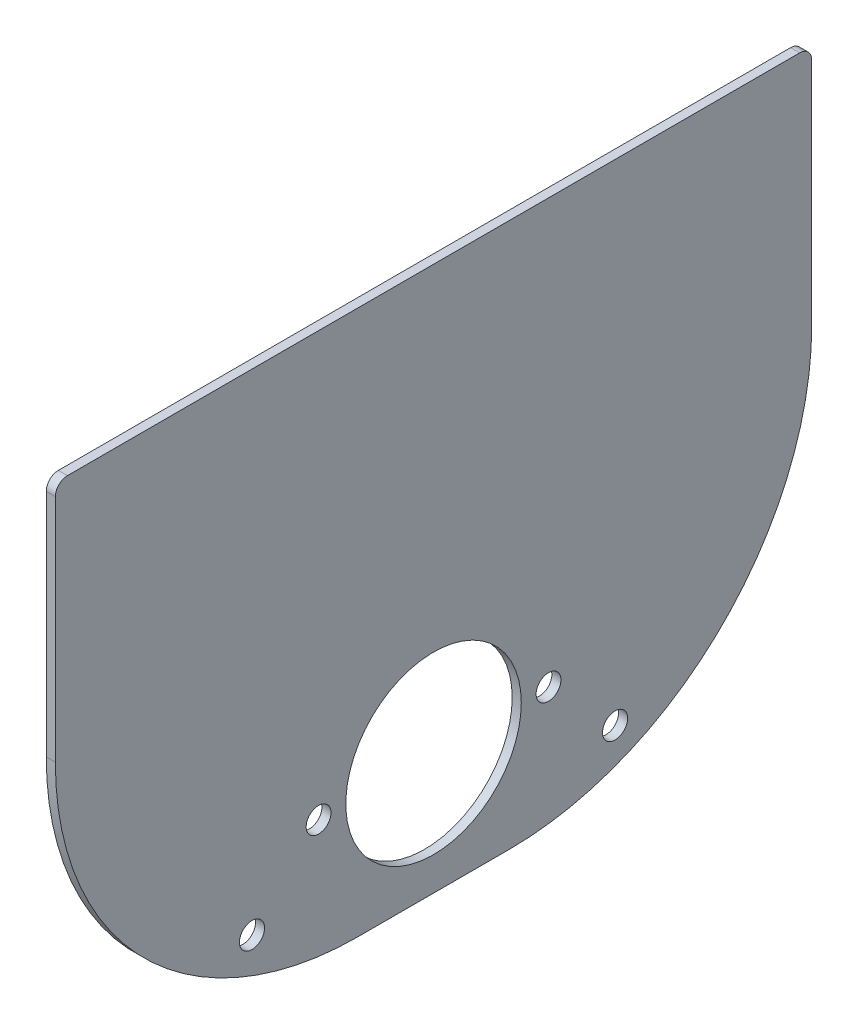
ISO-10303-21;
HEADER;
FILE_DESCRIPTION(('STEP AP214'),'2;1');
FILE_NAME('part.step','',(''),(''),'','','');
FILE_SCHEMA(('AUTOMOTIVE_DESIGN { 1 0 10303 214 1 1 1 1 }'));
ENDSEC;
DATA;
#1=APPLICATION_CONTEXT('core data for automotive mechanical design processes');
#2=APPLICATION_PROTOCOL_DEFINITION('international standard','automotive_design',2000,#1);
#3=PRODUCT_CONTEXT('',#1,'mechanical');
#4=PRODUCT('Part','Part','',(#3));
#5=PRODUCT_RELATED_PRODUCT_CATEGORY('part','',(#4));
#6=PRODUCT_DEFINITION_FORMATION('','',#4);
#7=PRODUCT_DEFINITION_CONTEXT('part definition',#1,'design');
#8=PRODUCT_DEFINITION('design','',#6,#7);
#9=PRODUCT_DEFINITION_SHAPE('','',#8);
#10=(LENGTH_UNIT() NAMED_UNIT(*) SI_UNIT(.MILLI.,.METRE.));
#11=(NAMED_UNIT(*) PLANE_ANGLE_UNIT() SI_UNIT($,.RADIAN.));
#12=(NAMED_UNIT(*) SI_UNIT($,.STERADIAN.) SOLID_ANGLE_UNIT());
#13=UNCERTAINTY_MEASURE_WITH_UNIT(LENGTH_MEASURE(1.E-05),#10,'distance_accuracy_value','');
#14=(GEOMETRIC_REPRESENTATION_CONTEXT(3) GLOBAL_UNCERTAINTY_ASSIGNED_CONTEXT((#13)) GLOBAL_UNIT_ASSIGNED_CONTEXT((#10,
#11,#12)) REPRESENTATION_CONTEXT('',''));
#15=CARTESIAN_POINT('',(0.,0.,0.));
#16=DIRECTION('',(0.,0.,1.));
#17=DIRECTION('',(1.,0.,0.));
#18=AXIS2_PLACEMENT_3D('',#15,#16,#17);
#19=CARTESIAN_POINT('',(3.,60.0000000000001,-25.));
#20=DIRECTION('',(1.,0.,0.));
#21=DIRECTION('',(0.,0.,-1.));
#22=AXIS2_PLACEMENT_3D('',#19,#20,#21);
#23=PLANE('',#22);
#24=CARTESIAN_POINT('',(3.,-22.,60.0000000000001));
#25=DIRECTION('',(1.,0.,0.));
#26=DIRECTION('',(0.,0.,-1.));
#27=AXIS2_PLACEMENT_3D('',#24,#25,#26);
#28=CIRCLE('',#27,4.15);
#29=CARTESIAN_POINT('',(3.,-22.,55.8500000000001));
#30=VERTEX_POINT('',#29);
#31=EDGE_CURVE('E205',#30,#30,#28,.T.);
#32=ORIENTED_EDGE('',*,*,#31,.F.);
#33=EDGE_LOOP('',(#32));
#34=FACE_BOUND('',#33,.T.);
#35=CARTESIAN_POINT('',(3.,0.,-38.));
#36=DIRECTION('',(1.,0.,0.));
#37=DIRECTION('',(0.,0.,-1.));
#38=AXIS2_PLACEMENT_3D('',#35,#36,#37);
#39=CIRCLE('',#38,4.1);
#40=CARTESIAN_POINT('',(3.,0.,-42.1));
#41=VERTEX_POINT('',#40);
#42=EDGE_CURVE('E193',#41,#41,#39,.T.);
#43=ORIENTED_EDGE('',*,*,#42,.F.);
#44=EDGE_LOOP('',(#43));
#45=FACE_BOUND('',#44,.T.);
#46=CARTESIAN_POINT('',(3.,60.0000000000001,-25.));
#47=DIRECTION('',(1.,0.,0.));
#48=DIRECTION('',(0.,0.,-1.));
#49=AXIS2_PLACEMENT_3D('',#46,#47,#48);
#50=CIRCLE('',#49,100.);
#51=CARTESIAN_POINT('',(3.,-40.,-25.));
#52=VERTEX_POINT('',#51);
#53=CARTESIAN_POINT('',(3.,60.0000000000001,-125.));
#54=VERTEX_POINT('',#53);
#55=EDGE_CURVE('E156',#52,#54,#50,.T.);
#56=ORIENTED_EDGE('',*,*,#55,.T.);
#57=DIRECTION('',(0.,1.,0.));
#58=VECTOR('',#57,1.);
#59=CARTESIAN_POINT('',(3.,136.,-125.));
#60=LINE('',#59,#58);
#61=CARTESIAN_POINT('',(3.,136.,-125.));
#62=VERTEX_POINT('',#61);
#63=EDGE_CURVE('E104',#54,#62,#60,.T.);
#64=ORIENTED_EDGE('',*,*,#63,.T.);
#65=CARTESIAN_POINT('',(3.,136.,-121.));
#66=DIRECTION('',(1.,0.,0.));
#67=DIRECTION('',(0.,0.,1.));
#68=AXIS2_PLACEMENT_3D('',#65,#66,#67);
#69=CIRCLE('',#68,3.99999999999999);
#70=CARTESIAN_POINT('',(3.,140.,-121.));
#71=VERTEX_POINT('',#70);
#72=EDGE_CURVE('E171',#62,#71,#69,.T.);
#73=ORIENTED_EDGE('',*,*,#72,.T.);
#74=DIRECTION('',(0.,0.,1.));
#75=VECTOR('',#74,1.);
#76=CARTESIAN_POINT('',(3.,140.,121.));
#77=LINE('',#76,#75);
#78=CARTESIAN_POINT('',(3.,140.,121.));
#79=VERTEX_POINT('',#78);
#80=EDGE_CURVE('E184',#71,#79,#77,.T.);
#81=ORIENTED_EDGE('',*,*,#80,.T.);
#82=CARTESIAN_POINT('',(3.,136.,121.));
#83=DIRECTION('',(1.,0.,0.));
#84=DIRECTION('',(0.,0.,-1.));
#85=AXIS2_PLACEMENT_3D('',#82,#83,#84);
#86=CIRCLE('',#85,4.);
#87=CARTESIAN_POINT('',(3.,136.,125.));
#88=VERTEX_POINT('',#87);
#89=EDGE_CURVE('E123',#79,#88,#86,.T.);
#90=ORIENTED_EDGE('',*,*,#89,.T.);
#91=DIRECTION('',(0.,-1.,0.));
#92=VECTOR('',#91,1.);
#93=CARTESIAN_POINT('',(3.,136.,125.));
#94=LINE('',#93,#92);
#95=CARTESIAN_POINT('',(3.,60.0000000000001,125.));
#96=VERTEX_POINT('',#95);
#97=EDGE_CURVE('E117',#88,#96,#94,.T.);
#98=ORIENTED_EDGE('',*,*,#97,.T.);
#99=CARTESIAN_POINT('',(3.,60.0000000000001,25.));
#100=DIRECTION('',(1.,0.,0.));
#101=DIRECTION('',(0.,0.,-1.));
#102=AXIS2_PLACEMENT_3D('',#99,#100,#101);
#103=CIRCLE('',#102,100.);
#104=CARTESIAN_POINT('',(3.,-40.,25.));
#105=VERTEX_POINT('',#104);
#106=EDGE_CURVE('E121',#96,#105,#103,.T.);
#107=ORIENTED_EDGE('',*,*,#106,.T.);
#108=DIRECTION('',(0.,0.,-1.));
#109=VECTOR('',#108,1.);
#110=CARTESIAN_POINT('',(3.,-40.,25.));
#111=LINE('',#110,#109);
#112=EDGE_CURVE('E61',#105,#52,#111,.T.);
#113=ORIENTED_EDGE('',*,*,#112,.T.);
#114=EDGE_LOOP('',(#56,#64,#73,#81,#90,#98,#107,#113));
#115=FACE_BOUND('',#114,.T.);
#116=CARTESIAN_POINT('',(3.,0.,0.));
#117=DIRECTION('',(1.,0.,0.));
#118=DIRECTION('',(0.,0.,-1.));
#119=AXIS2_PLACEMENT_3D('',#116,#117,#118);
#120=CIRCLE('',#119,29.);
#121=CARTESIAN_POINT('',(3.,0.,-29.));
#122=VERTEX_POINT('',#121);
#123=EDGE_CURVE('E145',#122,#122,#120,.T.);
#124=ORIENTED_EDGE('',*,*,#123,.F.);
#125=EDGE_LOOP('',(#124));
#126=FACE_BOUND('',#125,.T.);
#127=CARTESIAN_POINT('',(3.,0.,38.));
#128=DIRECTION('',(1.,0.,0.));
#129=DIRECTION('',(0.,0.,-1.));
#130=AXIS2_PLACEMENT_3D('',#127,#128,#129);
#131=CIRCLE('',#130,4.1);
#132=CARTESIAN_POINT('',(3.,0.,33.9));
#133=VERTEX_POINT('',#132);
#134=EDGE_CURVE('E199',#133,#133,#131,.T.);
#135=ORIENTED_EDGE('',*,*,#134,.F.);
#136=EDGE_LOOP('',(#135));
#137=FACE_BOUND('',#136,.T.);
#138=CARTESIAN_POINT('',(3.,-22.,-60.0000000000001));
#139=DIRECTION('',(1.,0.,0.));
#140=DIRECTION('',(0.,0.,-1.));
#141=AXIS2_PLACEMENT_3D('',#138,#139,#140);
#142=CIRCLE('',#141,4.14999999999999);
#143=CARTESIAN_POINT('',(3.,-22.,-64.1500000000001));
#144=VERTEX_POINT('',#143);
#145=EDGE_CURVE('E211',#144,#144,#142,.T.);
#146=ORIENTED_EDGE('',*,*,#145,.F.);
#147=EDGE_LOOP('',(#146));
#148=FACE_BOUND('',#147,.T.);
#149=ADVANCED_FACE('F44',(#34,#45,#115,#126,#137,#148),#23,.T.);
#150=CARTESIAN_POINT('',(0.,60.0000000000001,-25.));
#151=DIRECTION('',(1.,0.,0.));
#152=DIRECTION('',(0.,0.,-1.));
#153=AXIS2_PLACEMENT_3D('',#150,#151,#152);
#154=PLANE('',#153);
#155=CARTESIAN_POINT('',(0.,60.0000000000001,-25.));
#156=DIRECTION('',(1.,0.,0.));
#157=DIRECTION('',(0.,0.,-1.));
#158=AXIS2_PLACEMENT_3D('',#155,#156,#157);
#159=CIRCLE('',#158,100.);
#160=CARTESIAN_POINT('',(0.,-40.,-25.));
#161=VERTEX_POINT('',#160);
#162=CARTESIAN_POINT('',(0.,60.0000000000001,-125.));
#163=VERTEX_POINT('',#162);
#164=EDGE_CURVE('E141',#161,#163,#159,.T.);
#165=ORIENTED_EDGE('',*,*,#164,.F.);
#166=DIRECTION('',(0.,0.,-1.));
#167=VECTOR('',#166,1.);
#168=CARTESIAN_POINT('',(0.,-40.,25.));
#169=LINE('',#168,#167);
#170=CARTESIAN_POINT('',(0.,-40.,25.));
#171=VERTEX_POINT('',#170);
#172=EDGE_CURVE('E96',#171,#161,#169,.T.);
#173=ORIENTED_EDGE('',*,*,#172,.F.);
#174=CARTESIAN_POINT('',(0.,60.0000000000001,25.));
#175=DIRECTION('',(1.,0.,0.));
#176=DIRECTION('',(0.,0.,-1.));
#177=AXIS2_PLACEMENT_3D('',#174,#175,#176);
#178=CIRCLE('',#177,100.);
#179=CARTESIAN_POINT('',(0.,60.0000000000001,125.));
#180=VERTEX_POINT('',#179);
#181=EDGE_CURVE('E90',#180,#171,#178,.T.);
#182=ORIENTED_EDGE('',*,*,#181,.F.);
#183=DIRECTION('',(0.,-1.,0.));
#184=VECTOR('',#183,1.);
#185=CARTESIAN_POINT('',(0.,136.,125.));
#186=LINE('',#185,#184);
#187=CARTESIAN_POINT('',(0.,136.,125.));
#188=VERTEX_POINT('',#187);
#189=EDGE_CURVE('E131',#188,#180,#186,.T.);
#190=ORIENTED_EDGE('',*,*,#189,.F.);
#191=CARTESIAN_POINT('',(0.,136.,121.));
#192=DIRECTION('',(1.,0.,0.));
#193=DIRECTION('',(0.,0.,-1.));
#194=AXIS2_PLACEMENT_3D('',#191,#192,#193);
#195=CIRCLE('',#194,4.);
#196=CARTESIAN_POINT('',(0.,140.,121.));
#197=VERTEX_POINT('',#196);
#198=EDGE_CURVE('E151',#197,#188,#195,.T.);
#199=ORIENTED_EDGE('',*,*,#198,.F.);
#200=DIRECTION('',(0.,0.,1.));
#201=VECTOR('',#200,1.);
#202=CARTESIAN_POINT('',(0.,140.,121.));
#203=LINE('',#202,#201);
#204=CARTESIAN_POINT('',(0.,140.,-121.));
#205=VERTEX_POINT('',#204);
#206=EDGE_CURVE('E149',#205,#197,#203,.T.);
#207=ORIENTED_EDGE('',*,*,#206,.F.);
#208=CARTESIAN_POINT('',(0.,136.,-121.));
#209=DIRECTION('',(1.,0.,0.));
#210=DIRECTION('',(0.,0.,1.));
#211=AXIS2_PLACEMENT_3D('',#208,#209,#210);
#212=CIRCLE('',#211,3.99999999999999);
#213=CARTESIAN_POINT('',(0.,136.,-125.));
#214=VERTEX_POINT('',#213);
#215=EDGE_CURVE('E147',#214,#205,#212,.T.);
#216=ORIENTED_EDGE('',*,*,#215,.F.);
#217=DIRECTION('',(0.,1.,0.));
#218=VECTOR('',#217,1.);
#219=CARTESIAN_POINT('',(0.,136.,-125.));
#220=LINE('',#219,#218);
#221=EDGE_CURVE('E144',#163,#214,#220,.T.);
#222=ORIENTED_EDGE('',*,*,#221,.F.);
#223=EDGE_LOOP('',(#165,#173,#182,#190,#199,#207,#216,#222));
#224=FACE_BOUND('',#223,.T.);
#225=CARTESIAN_POINT('',(0.,0.,0.));
#226=DIRECTION('',(1.,0.,0.));
#227=DIRECTION('',(0.,0.,-1.));
#228=AXIS2_PLACEMENT_3D('',#225,#226,#227);
#229=CIRCLE('',#228,29.);
#230=CARTESIAN_POINT('',(0.,0.,-29.));
#231=VERTEX_POINT('',#230);
#232=EDGE_CURVE('E190',#231,#231,#229,.T.);
#233=ORIENTED_EDGE('',*,*,#232,.T.);
#234=EDGE_LOOP('',(#233));
#235=FACE_BOUND('',#234,.T.);
#236=CARTESIAN_POINT('',(0.,0.,-38.));
#237=DIRECTION('',(1.,0.,0.));
#238=DIRECTION('',(0.,0.,-1.));
#239=AXIS2_PLACEMENT_3D('',#236,#237,#238);
#240=CIRCLE('',#239,4.1);
#241=CARTESIAN_POINT('',(0.,0.,-42.1));
#242=VERTEX_POINT('',#241);
#243=EDGE_CURVE('E196',#242,#242,#240,.T.);
#244=ORIENTED_EDGE('',*,*,#243,.T.);
#245=EDGE_LOOP('',(#244));
#246=FACE_BOUND('',#245,.T.);
#247=CARTESIAN_POINT('',(0.,0.,38.));
#248=DIRECTION('',(1.,0.,0.));
#249=DIRECTION('',(0.,0.,-1.));
#250=AXIS2_PLACEMENT_3D('',#247,#248,#249);
#251=CIRCLE('',#250,4.1);
#252=CARTESIAN_POINT('',(0.,0.,33.9));
#253=VERTEX_POINT('',#252);
#254=EDGE_CURVE('E202',#253,#253,#251,.T.);
#255=ORIENTED_EDGE('',*,*,#254,.T.);
#256=EDGE_LOOP('',(#255));
#257=FACE_BOUND('',#256,.T.);
#258=CARTESIAN_POINT('',(0.,-22.,60.0000000000001));
#259=DIRECTION('',(1.,0.,0.));
#260=DIRECTION('',(0.,0.,-1.));
#261=AXIS2_PLACEMENT_3D('',#258,#259,#260);
#262=CIRCLE('',#261,4.15);
#263=CARTESIAN_POINT('',(0.,-22.,55.8500000000001));
#264=VERTEX_POINT('',#263);
#265=EDGE_CURVE('E208',#264,#264,#262,.T.);
#266=ORIENTED_EDGE('',*,*,#265,.T.);
#267=EDGE_LOOP('',(#266));
#268=FACE_BOUND('',#267,.T.);
#269=CARTESIAN_POINT('',(0.,-22.,-60.0000000000001));
#270=DIRECTION('',(1.,0.,0.));
#271=DIRECTION('',(0.,0.,-1.));
#272=AXIS2_PLACEMENT_3D('',#269,#270,#271);
#273=CIRCLE('',#272,4.14999999999999);
#274=CARTESIAN_POINT('',(0.,-22.,-64.1500000000001));
#275=VERTEX_POINT('',#274);
#276=EDGE_CURVE('E214',#275,#275,#273,.T.);
#277=ORIENTED_EDGE('',*,*,#276,.T.);
#278=EDGE_LOOP('',(#277));
#279=FACE_BOUND('',#278,.T.);
#280=ADVANCED_FACE('F175',(#224,#235,#246,#257,#268,#279),#154,.F.);
#281=CARTESIAN_POINT('',(3.,60.0000000000001,-25.));
#282=DIRECTION('',(-1.,0.,0.));
#283=DIRECTION('',(0.,0.,1.));
#284=AXIS2_PLACEMENT_3D('',#281,#282,#283);
#285=CYLINDRICAL_SURFACE('',#284,100.);
#286=ORIENTED_EDGE('',*,*,#164,.T.);
#287=DIRECTION('',(-1.,0.,0.));
#288=VECTOR('',#287,1.);
#289=CARTESIAN_POINT('',(3.,60.0000000000001,-125.));
#290=LINE('',#289,#288);
#291=EDGE_CURVE('E13',#54,#163,#290,.T.);
#292=ORIENTED_EDGE('',*,*,#291,.F.);
#293=ORIENTED_EDGE('',*,*,#55,.F.);
#294=DIRECTION('',(-1.,0.,0.));
#295=VECTOR('',#294,1.);
#296=CARTESIAN_POINT('',(3.,-40.,-25.));
#297=LINE('',#296,#295);
#298=EDGE_CURVE('E137',#52,#161,#297,.T.);
#299=ORIENTED_EDGE('',*,*,#298,.T.);
#300=EDGE_LOOP('',(#286,#292,#293,#299));
#301=FACE_BOUND('',#300,.T.);
#302=ADVANCED_FACE('F46',(#301),#285,.T.);
#303=CARTESIAN_POINT('',(3.,136.,-125.));
#304=DIRECTION('',(0.,0.,1.));
#305=DIRECTION('',(0.,-1.,0.));
#306=AXIS2_PLACEMENT_3D('',#303,#304,#305);
#307=PLANE('',#306);
#308=ORIENTED_EDGE('',*,*,#221,.T.);
#309=DIRECTION('',(-1.,0.,0.));
#310=VECTOR('',#309,1.);
#311=CARTESIAN_POINT('',(3.,136.,-125.));
#312=LINE('',#311,#310);
#313=EDGE_CURVE('E53',#62,#214,#312,.T.);
#314=ORIENTED_EDGE('',*,*,#313,.F.);
#315=ORIENTED_EDGE('',*,*,#63,.F.);
#316=ORIENTED_EDGE('',*,*,#291,.T.);
#317=EDGE_LOOP('',(#308,#314,#315,#316));
#318=FACE_BOUND('',#317,.T.);
#319=ADVANCED_FACE('F248',(#318),#307,.F.);
#320=CARTESIAN_POINT('',(3.,136.,-121.));
#321=DIRECTION('',(-1.,0.,0.));
#322=DIRECTION('',(0.,0.,1.));
#323=AXIS2_PLACEMENT_3D('',#320,#321,#322);
#324=CYLINDRICAL_SURFACE('',#323,3.99999999999999);
#325=ORIENTED_EDGE('',*,*,#215,.T.);
#326=DIRECTION('',(-1.,0.,0.));
#327=VECTOR('',#326,1.);
#328=CARTESIAN_POINT('',(3.,140.,-121.));
#329=LINE('',#328,#327);
#330=EDGE_CURVE('E163',#71,#205,#329,.T.);
#331=ORIENTED_EDGE('',*,*,#330,.F.);
#332=ORIENTED_EDGE('',*,*,#72,.F.);
#333=ORIENTED_EDGE('',*,*,#313,.T.);
#334=EDGE_LOOP('',(#325,#331,#332,#333));
#335=FACE_BOUND('',#334,.T.);
#336=ADVANCED_FACE('F169',(#335),#324,.T.);
#337=CARTESIAN_POINT('',(3.,140.,121.));
#338=DIRECTION('',(0.,-1.,0.));
#339=DIRECTION('',(0.,0.,-1.));
#340=AXIS2_PLACEMENT_3D('',#337,#338,#339);
#341=PLANE('',#340);
#342=ORIENTED_EDGE('',*,*,#206,.T.);
#343=DIRECTION('',(-1.,0.,0.));
#344=VECTOR('',#343,1.);
#345=CARTESIAN_POINT('',(3.,140.,121.));
#346=LINE('',#345,#344);
#347=EDGE_CURVE('E160',#79,#197,#346,.T.);
#348=ORIENTED_EDGE('',*,*,#347,.F.);
#349=ORIENTED_EDGE('',*,*,#80,.F.);
#350=ORIENTED_EDGE('',*,*,#330,.T.);
#351=EDGE_LOOP('',(#342,#348,#349,#350));
#352=FACE_BOUND('',#351,.T.);
#353=ADVANCED_FACE('F180',(#352),#341,.F.);
#354=CARTESIAN_POINT('',(3.,136.,121.));
#355=DIRECTION('',(-1.,0.,0.));
#356=DIRECTION('',(0.,0.,1.));
#357=AXIS2_PLACEMENT_3D('',#354,#355,#356);
#358=CYLINDRICAL_SURFACE('',#357,4.);
#359=ORIENTED_EDGE('',*,*,#198,.T.);
#360=DIRECTION('',(-1.,0.,0.));
#361=VECTOR('',#360,1.);
#362=CARTESIAN_POINT('',(3.,136.,125.));
#363=LINE('',#362,#361);
#364=EDGE_CURVE('E132',#88,#188,#363,.T.);
#365=ORIENTED_EDGE('',*,*,#364,.F.);
#366=ORIENTED_EDGE('',*,*,#89,.F.);
#367=ORIENTED_EDGE('',*,*,#347,.T.);
#368=EDGE_LOOP('',(#359,#365,#366,#367));
#369=FACE_BOUND('',#368,.T.);
#370=ADVANCED_FACE('F183',(#369),#358,.T.);
#371=CARTESIAN_POINT('',(3.,136.,125.));
#372=DIRECTION('',(0.,0.,-1.));
#373=DIRECTION('',(0.,1.,0.));
#374=AXIS2_PLACEMENT_3D('',#371,#372,#373);
#375=PLANE('',#374);
#376=ORIENTED_EDGE('',*,*,#189,.T.);
#377=DIRECTION('',(-1.,0.,0.));
#378=VECTOR('',#377,1.);
#379=CARTESIAN_POINT('',(3.,60.0000000000001,125.));
#380=LINE('',#379,#378);
#381=EDGE_CURVE('E128',#96,#180,#380,.T.);
#382=ORIENTED_EDGE('',*,*,#381,.F.);
#383=ORIENTED_EDGE('',*,*,#97,.F.);
#384=ORIENTED_EDGE('',*,*,#364,.T.);
#385=EDGE_LOOP('',(#376,#382,#383,#384));
#386=FACE_BOUND('',#385,.T.);
#387=ADVANCED_FACE('F129',(#386),#375,.F.);
#388=CARTESIAN_POINT('',(3.,60.0000000000001,25.));
#389=DIRECTION('',(-1.,0.,0.));
#390=DIRECTION('',(0.,0.,1.));
#391=AXIS2_PLACEMENT_3D('',#388,#389,#390);
#392=CYLINDRICAL_SURFACE('',#391,100.);
#393=ORIENTED_EDGE('',*,*,#181,.T.);
#394=DIRECTION('',(-1.,0.,0.));
#395=VECTOR('',#394,1.);
#396=CARTESIAN_POINT('',(3.,-40.,25.));
#397=LINE('',#396,#395);
#398=EDGE_CURVE('E133',#105,#171,#397,.T.);
#399=ORIENTED_EDGE('',*,*,#398,.F.);
#400=ORIENTED_EDGE('',*,*,#106,.F.);
#401=ORIENTED_EDGE('',*,*,#381,.T.);
#402=EDGE_LOOP('',(#393,#399,#400,#401));
#403=FACE_BOUND('',#402,.T.);
#404=ADVANCED_FACE('F135',(#403),#392,.T.);
#405=CARTESIAN_POINT('',(3.,-40.,25.));
#406=DIRECTION('',(0.,1.,0.));
#407=DIRECTION('',(0.,0.,1.));
#408=AXIS2_PLACEMENT_3D('',#405,#406,#407);
#409=PLANE('',#408);
#410=ORIENTED_EDGE('',*,*,#172,.T.);
#411=ORIENTED_EDGE('',*,*,#298,.F.);
#412=ORIENTED_EDGE('',*,*,#112,.F.);
#413=ORIENTED_EDGE('',*,*,#398,.T.);
#414=EDGE_LOOP('',(#410,#411,#412,#413));
#415=FACE_BOUND('',#414,.T.);
#416=ADVANCED_FACE('F236',(#415),#409,.F.);
#417=CARTESIAN_POINT('',(3.,0.,0.));
#418=DIRECTION('',(-1.,0.,0.));
#419=DIRECTION('',(0.,0.,1.));
#420=AXIS2_PLACEMENT_3D('',#417,#418,#419);
#421=CYLINDRICAL_SURFACE('',#420,29.);
#422=ORIENTED_EDGE('',*,*,#123,.T.);
#423=EDGE_LOOP('',(#422));
#424=FACE_BOUND('',#423,.T.);
#425=ORIENTED_EDGE('',*,*,#232,.F.);
#426=EDGE_LOOP('',(#425));
#427=FACE_BOUND('',#426,.T.);
#428=ADVANCED_FACE('F233',(#424,#427),#421,.F.);
#429=CARTESIAN_POINT('',(3.,0.,-38.));
#430=DIRECTION('',(-1.,0.,0.));
#431=DIRECTION('',(0.,0.,1.));
#432=AXIS2_PLACEMENT_3D('',#429,#430,#431);
#433=CYLINDRICAL_SURFACE('',#432,4.1);
#434=ORIENTED_EDGE('',*,*,#42,.T.);
#435=EDGE_LOOP('',(#434));
#436=FACE_BOUND('',#435,.T.);
#437=ORIENTED_EDGE('',*,*,#243,.F.);
#438=EDGE_LOOP('',(#437));
#439=FACE_BOUND('',#438,.T.);
#440=ADVANCED_FACE('F312',(#436,#439),#433,.F.);
#441=CARTESIAN_POINT('',(3.,0.,38.));
#442=DIRECTION('',(-1.,0.,0.));
#443=DIRECTION('',(0.,0.,1.));
#444=AXIS2_PLACEMENT_3D('',#441,#442,#443);
#445=CYLINDRICAL_SURFACE('',#444,4.1);
#446=ORIENTED_EDGE('',*,*,#134,.T.);
#447=EDGE_LOOP('',(#446));
#448=FACE_BOUND('',#447,.T.);
#449=ORIENTED_EDGE('',*,*,#254,.F.);
#450=EDGE_LOOP('',(#449));
#451=FACE_BOUND('',#450,.T.);
#452=ADVANCED_FACE('F320',(#448,#451),#445,.F.);
#453=CARTESIAN_POINT('',(3.,-22.,60.0000000000001));
#454=DIRECTION('',(-1.,0.,0.));
#455=DIRECTION('',(0.,0.,1.));
#456=AXIS2_PLACEMENT_3D('',#453,#454,#455);
#457=CYLINDRICAL_SURFACE('',#456,4.15);
#458=ORIENTED_EDGE('',*,*,#31,.T.);
#459=EDGE_LOOP('',(#458));
#460=FACE_BOUND('',#459,.T.);
#461=ORIENTED_EDGE('',*,*,#265,.F.);
#462=EDGE_LOOP('',(#461));
#463=FACE_BOUND('',#462,.T.);
#464=ADVANCED_FACE('F328',(#460,#463),#457,.F.);
#465=CARTESIAN_POINT('',(3.,-22.,-60.0000000000001));
#466=DIRECTION('',(-1.,0.,0.));
#467=DIRECTION('',(0.,0.,1.));
#468=AXIS2_PLACEMENT_3D('',#465,#466,#467);
#469=CYLINDRICAL_SURFACE('',#468,4.14999999999999);
#470=ORIENTED_EDGE('',*,*,#145,.T.);
#471=EDGE_LOOP('',(#470));
#472=FACE_BOUND('',#471,.T.);
#473=ORIENTED_EDGE('',*,*,#276,.F.);
#474=EDGE_LOOP('',(#473));
#475=FACE_BOUND('',#474,.T.);
#476=ADVANCED_FACE('F220',(#472,#475),#469,.F.);
#477=CLOSED_SHELL('',(#149,#280,#302,#319,#336,#353,#370,#387,#404,#416,#428,#440,#452,#464,#476));
#478=MANIFOLD_SOLID_BREP('B2',#477);
#479=ADVANCED_BREP_SHAPE_REPRESENTATION('',(#18,#478),#14);
#480=SHAPE_DEFINITION_REPRESENTATION(#9,#479);
ENDSEC;
END-ISO-10303-21;
